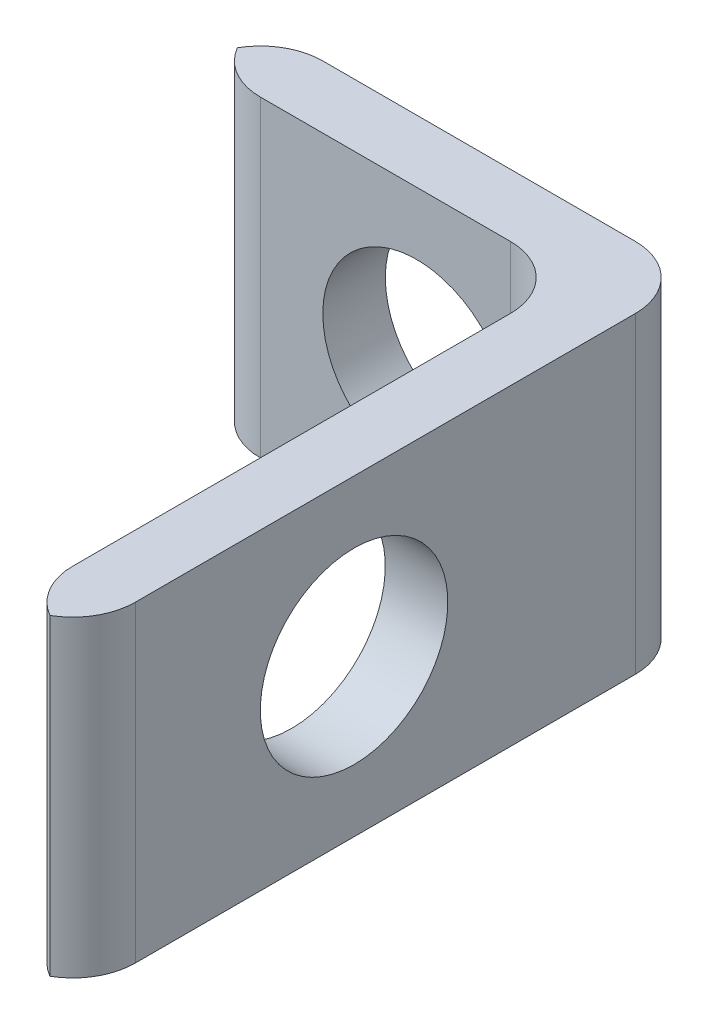
ISO-10303-21;
HEADER;
FILE_DESCRIPTION(('STEP AP214'),'2;1');
FILE_NAME('part.step','',(''),(''),'','','');
FILE_SCHEMA(('AUTOMOTIVE_DESIGN { 1 0 10303 214 1 1 1 1 }'));
ENDSEC;
DATA;
#1=APPLICATION_CONTEXT('core data for automotive mechanical design processes');
#2=APPLICATION_PROTOCOL_DEFINITION('international standard','automotive_design',2000,#1);
#3=PRODUCT_CONTEXT('',#1,'mechanical');
#4=PRODUCT('Part','Part','',(#3));
#5=PRODUCT_RELATED_PRODUCT_CATEGORY('part','',(#4));
#6=PRODUCT_DEFINITION_FORMATION('','',#4);
#7=PRODUCT_DEFINITION_CONTEXT('part definition',#1,'design');
#8=PRODUCT_DEFINITION('design','',#6,#7);
#9=PRODUCT_DEFINITION_SHAPE('','',#8);
#10=(LENGTH_UNIT() NAMED_UNIT(*) SI_UNIT(.MILLI.,.METRE.));
#11=(NAMED_UNIT(*) PLANE_ANGLE_UNIT() SI_UNIT($,.RADIAN.));
#12=(NAMED_UNIT(*) SI_UNIT($,.STERADIAN.) SOLID_ANGLE_UNIT());
#13=UNCERTAINTY_MEASURE_WITH_UNIT(LENGTH_MEASURE(1.E-05),#10,'distance_accuracy_value','');
#14=(GEOMETRIC_REPRESENTATION_CONTEXT(3) GLOBAL_UNCERTAINTY_ASSIGNED_CONTEXT((#13)) GLOBAL_UNIT_ASSIGNED_CONTEXT((#10,
#11,#12)) REPRESENTATION_CONTEXT('',''));
#15=CARTESIAN_POINT('',(0.,0.,0.));
#16=DIRECTION('',(0.,0.,1.));
#17=DIRECTION('',(1.,0.,0.));
#18=AXIS2_PLACEMENT_3D('',#15,#16,#17);
#19=CARTESIAN_POINT('',(0.,0.,1.));
#20=DIRECTION('',(0.,0.,-1.));
#21=DIRECTION('',(-1.,0.,0.));
#22=AXIS2_PLACEMENT_3D('',#19,#20,#21);
#23=PLANE('',#22);
#24=DIRECTION('',(-1.,0.,0.));
#25=VECTOR('',#24,1.);
#26=CARTESIAN_POINT('',(0.,5.,1.));
#27=LINE('',#26,#25);
#28=CARTESIAN_POINT('',(5.,5.,1.));
#29=VERTEX_POINT('',#28);
#30=CARTESIAN_POINT('',(1.,5.,1.));
#31=VERTEX_POINT('',#30);
#32=EDGE_CURVE('E230',#29,#31,#27,.T.);
#33=ORIENTED_EDGE('',*,*,#32,.T.);
#34=DIRECTION('',(0.,-1.,0.));
#35=VECTOR('',#34,1.);
#36=CARTESIAN_POINT('',(1.,0.,1.));
#37=LINE('',#36,#35);
#38=CARTESIAN_POINT('',(1.,0.,1.));
#39=VERTEX_POINT('',#38);
#40=EDGE_CURVE('E201',#31,#39,#37,.T.);
#41=ORIENTED_EDGE('',*,*,#40,.T.);
#42=DIRECTION('',(1.,0.,0.));
#43=VECTOR('',#42,1.);
#44=CARTESIAN_POINT('',(0.,0.,1.));
#45=LINE('',#44,#43);
#46=CARTESIAN_POINT('',(5.,0.,1.));
#47=VERTEX_POINT('',#46);
#48=EDGE_CURVE('E233',#39,#47,#45,.T.);
#49=ORIENTED_EDGE('',*,*,#48,.T.);
#50=DIRECTION('',(0.,-1.,0.));
#51=VECTOR('',#50,1.);
#52=CARTESIAN_POINT('',(5.,5.,1.));
#53=LINE('',#52,#51);
#54=CARTESIAN_POINT('',(5.,2.5,1.));
#55=VERTEX_POINT('',#54);
#56=EDGE_CURVE('E144',#47,#55,#53,.F.);
#57=ORIENTED_EDGE('',*,*,#56,.T.);
#58=CARTESIAN_POINT('',(3.5,2.5,1.));
#59=DIRECTION('',(0.,0.,1.));
#60=DIRECTION('',(1.,0.,0.));
#61=AXIS2_PLACEMENT_3D('',#58,#59,#60);
#62=CIRCLE('',#61,1.5);
#63=EDGE_CURVE('E241',#55,#55,#62,.T.);
#64=ORIENTED_EDGE('',*,*,#63,.F.);
#65=DIRECTION('',(0.,-1.,0.));
#66=VECTOR('',#65,1.);
#67=CARTESIAN_POINT('',(5.,5.,1.));
#68=LINE('',#67,#66);
#69=EDGE_CURVE('E152',#55,#29,#68,.F.);
#70=ORIENTED_EDGE('',*,*,#69,.T.);
#71=EDGE_LOOP('',(#33,#41,#49,#57,#64,#70));
#72=FACE_BOUND('',#71,.T.);
#73=ADVANCED_FACE('F43',(#72),#23,.F.);
#74=CARTESIAN_POINT('',(0.,0.,0.));
#75=DIRECTION('',(0.,0.,-1.));
#76=DIRECTION('',(-1.,0.,0.));
#77=AXIS2_PLACEMENT_3D('',#74,#75,#76);
#78=PLANE('',#77);
#79=DIRECTION('',(-1.,0.,0.));
#80=VECTOR('',#79,1.);
#81=CARTESIAN_POINT('',(0.,5.,0.));
#82=LINE('',#81,#80);
#83=CARTESIAN_POINT('',(6.,5.,0.));
#84=VERTEX_POINT('',#83);
#85=CARTESIAN_POINT('',(1.,5.,0.));
#86=VERTEX_POINT('',#85);
#87=EDGE_CURVE('E236',#84,#86,#82,.T.);
#88=ORIENTED_EDGE('',*,*,#87,.F.);
#89=DIRECTION('',(0.,1.,0.));
#90=VECTOR('',#89,1.);
#91=CARTESIAN_POINT('',(6.,0.,0.));
#92=LINE('',#91,#90);
#93=CARTESIAN_POINT('',(6.,0.,0.));
#94=VERTEX_POINT('',#93);
#95=EDGE_CURVE('E52',#84,#94,#92,.F.);
#96=ORIENTED_EDGE('',*,*,#95,.T.);
#97=DIRECTION('',(1.,0.,0.));
#98=VECTOR('',#97,1.);
#99=CARTESIAN_POINT('',(0.,0.,0.));
#100=LINE('',#99,#98);
#101=CARTESIAN_POINT('',(1.,0.,0.));
#102=VERTEX_POINT('',#101);
#103=EDGE_CURVE('E239',#102,#94,#100,.T.);
#104=ORIENTED_EDGE('',*,*,#103,.F.);
#105=DIRECTION('',(0.,-1.,0.));
#106=VECTOR('',#105,1.);
#107=CARTESIAN_POINT('',(1.,5.,0.));
#108=LINE('',#107,#106);
#109=EDGE_CURVE('E197',#102,#86,#108,.F.);
#110=ORIENTED_EDGE('',*,*,#109,.T.);
#111=EDGE_LOOP('',(#88,#96,#104,#110));
#112=FACE_BOUND('',#111,.T.);
#113=CARTESIAN_POINT('',(3.5,2.5,0.));
#114=DIRECTION('',(0.,0.,1.));
#115=DIRECTION('',(1.,0.,0.));
#116=AXIS2_PLACEMENT_3D('',#113,#114,#115);
#117=CIRCLE('',#116,1.5);
#118=CARTESIAN_POINT('',(5.,2.5,0.));
#119=VERTEX_POINT('',#118);
#120=EDGE_CURVE('E245',#119,#119,#117,.T.);
#121=ORIENTED_EDGE('',*,*,#120,.T.);
#122=EDGE_LOOP('',(#121));
#123=FACE_BOUND('',#122,.T.);
#124=ADVANCED_FACE('F277',(#112,#123),#78,.T.);
#125=CARTESIAN_POINT('',(0.,0.,1.));
#126=DIRECTION('',(0.,1.,0.));
#127=DIRECTION('',(0.,0.,1.));
#128=AXIS2_PLACEMENT_3D('',#125,#126,#127);
#129=PLANE('',#128);
#130=ORIENTED_EDGE('',*,*,#103,.T.);
#131=CARTESIAN_POINT('',(6.,0.,1.));
#132=DIRECTION('',(0.,1.,0.));
#133=DIRECTION('',(0.,0.,1.));
#134=AXIS2_PLACEMENT_3D('',#131,#132,#133);
#135=CIRCLE('',#134,1.);
#136=CARTESIAN_POINT('',(7.,0.,1.));
#137=VERTEX_POINT('',#136);
#138=EDGE_CURVE('E11',#94,#137,#135,.F.);
#139=ORIENTED_EDGE('',*,*,#138,.T.);
#140=DIRECTION('',(0.,0.,-1.));
#141=VECTOR('',#140,1.);
#142=CARTESIAN_POINT('',(7.,0.,1.));
#143=LINE('',#142,#141);
#144=CARTESIAN_POINT('',(7.,0.,9.));
#145=VERTEX_POINT('',#144);
#146=EDGE_CURVE('E153',#145,#137,#143,.T.);
#147=ORIENTED_EDGE('',*,*,#146,.F.);
#148=CARTESIAN_POINT('',(6.,0.,9.));
#149=DIRECTION('',(0.,1.,0.));
#150=DIRECTION('',(0.,0.,1.));
#151=AXIS2_PLACEMENT_3D('',#148,#149,#150);
#152=CIRCLE('',#151,1.);
#153=CARTESIAN_POINT('',(6.5,0.,9.86602540378444));
#154=VERTEX_POINT('',#153);
#155=EDGE_CURVE('E191',#145,#154,#152,.F.);
#156=ORIENTED_EDGE('',*,*,#155,.T.);
#157=CARTESIAN_POINT('',(7.,0.,9.));
#158=DIRECTION('',(0.,1.,0.));
#159=DIRECTION('',(0.,0.,1.));
#160=AXIS2_PLACEMENT_3D('',#157,#158,#159);
#161=CIRCLE('',#160,1.);
#162=CARTESIAN_POINT('',(6.,0.,9.));
#163=VERTEX_POINT('',#162);
#164=EDGE_CURVE('E130',#154,#163,#161,.F.);
#165=ORIENTED_EDGE('',*,*,#164,.T.);
#166=DIRECTION('',(0.,0.,-1.));
#167=VECTOR('',#166,1.);
#168=CARTESIAN_POINT('',(6.,0.,10.));
#169=LINE('',#168,#167);
#170=CARTESIAN_POINT('',(6.,0.,2.));
#171=VERTEX_POINT('',#170);
#172=EDGE_CURVE('E123',#163,#171,#169,.T.);
#173=ORIENTED_EDGE('',*,*,#172,.T.);
#174=CARTESIAN_POINT('',(5.,0.,2.));
#175=DIRECTION('',(0.,1.,0.));
#176=DIRECTION('',(0.,0.,1.));
#177=AXIS2_PLACEMENT_3D('',#174,#175,#176);
#178=CIRCLE('',#177,1.);
#179=EDGE_CURVE('E127',#171,#47,#178,.T.);
#180=ORIENTED_EDGE('',*,*,#179,.T.);
#181=ORIENTED_EDGE('',*,*,#48,.F.);
#182=CARTESIAN_POINT('',(1.,0.,0.));
#183=DIRECTION('',(0.,1.,0.));
#184=DIRECTION('',(0.,0.,1.));
#185=AXIS2_PLACEMENT_3D('',#182,#183,#184);
#186=CIRCLE('',#185,1.);
#187=CARTESIAN_POINT('',(0.133974596215561,0.,0.5));
#188=VERTEX_POINT('',#187);
#189=EDGE_CURVE('E183',#39,#188,#186,.F.);
#190=ORIENTED_EDGE('',*,*,#189,.T.);
#191=CARTESIAN_POINT('',(1.,0.,1.));
#192=DIRECTION('',(0.,1.,0.));
#193=DIRECTION('',(0.,0.,1.));
#194=AXIS2_PLACEMENT_3D('',#191,#192,#193);
#195=CIRCLE('',#194,1.);
#196=EDGE_CURVE('E186',#188,#102,#195,.F.);
#197=ORIENTED_EDGE('',*,*,#196,.T.);
#198=EDGE_LOOP('',(#130,#139,#147,#156,#165,#173,#180,#181,#190,#197));
#199=FACE_BOUND('',#198,.T.);
#200=ADVANCED_FACE('F125',(#199),#129,.F.);
#201=CARTESIAN_POINT('',(7.,0.,1.));
#202=DIRECTION('',(-1.,0.,0.));
#203=DIRECTION('',(0.,0.,1.));
#204=AXIS2_PLACEMENT_3D('',#201,#202,#203);
#205=PLANE('',#204);
#206=CARTESIAN_POINT('',(7.,2.5,5.5));
#207=DIRECTION('',(-1.,0.,0.));
#208=DIRECTION('',(0.,-1.,0.));
#209=AXIS2_PLACEMENT_3D('',#206,#207,#208);
#210=CIRCLE('',#209,1.5);
#211=CARTESIAN_POINT('',(7.,1.,5.5));
#212=VERTEX_POINT('',#211);
#213=EDGE_CURVE('E136',#212,#212,#210,.T.);
#214=ORIENTED_EDGE('',*,*,#213,.T.);
#215=EDGE_LOOP('',(#214));
#216=FACE_BOUND('',#215,.T.);
#217=ORIENTED_EDGE('',*,*,#146,.T.);
#218=DIRECTION('',(0.,1.,0.));
#219=VECTOR('',#218,1.);
#220=CARTESIAN_POINT('',(7.,5.,1.));
#221=LINE('',#220,#219);
#222=CARTESIAN_POINT('',(7.,5.,1.));
#223=VERTEX_POINT('',#222);
#224=EDGE_CURVE('E204',#137,#223,#221,.T.);
#225=ORIENTED_EDGE('',*,*,#224,.T.);
#226=DIRECTION('',(0.,0.,-1.));
#227=VECTOR('',#226,1.);
#228=CARTESIAN_POINT('',(7.,5.,1.));
#229=LINE('',#228,#227);
#230=CARTESIAN_POINT('',(7.,5.,9.));
#231=VERTEX_POINT('',#230);
#232=EDGE_CURVE('E159',#231,#223,#229,.T.);
#233=ORIENTED_EDGE('',*,*,#232,.F.);
#234=DIRECTION('',(0.,1.,0.));
#235=VECTOR('',#234,1.);
#236=CARTESIAN_POINT('',(7.,0.,9.));
#237=LINE('',#236,#235);
#238=EDGE_CURVE('E179',#231,#145,#237,.F.);
#239=ORIENTED_EDGE('',*,*,#238,.T.);
#240=EDGE_LOOP('',(#217,#225,#233,#239));
#241=FACE_BOUND('',#240,.T.);
#242=ADVANCED_FACE('F222',(#216,#241),#205,.F.);
#243=CARTESIAN_POINT('',(0.,5.,1.));
#244=DIRECTION('',(0.,-1.,0.));
#245=DIRECTION('',(0.,0.,-1.));
#246=AXIS2_PLACEMENT_3D('',#243,#244,#245);
#247=PLANE('',#246);
#248=ORIENTED_EDGE('',*,*,#232,.T.);
#249=CARTESIAN_POINT('',(6.,5.,1.));
#250=DIRECTION('',(0.,-1.,0.));
#251=DIRECTION('',(0.,0.,-1.));
#252=AXIS2_PLACEMENT_3D('',#249,#250,#251);
#253=CIRCLE('',#252,1.);
#254=EDGE_CURVE('E66',#223,#84,#253,.F.);
#255=ORIENTED_EDGE('',*,*,#254,.T.);
#256=ORIENTED_EDGE('',*,*,#87,.T.);
#257=CARTESIAN_POINT('',(1.,5.,1.));
#258=DIRECTION('',(0.,-1.,0.));
#259=DIRECTION('',(0.,0.,-1.));
#260=AXIS2_PLACEMENT_3D('',#257,#258,#259);
#261=CIRCLE('',#260,1.);
#262=CARTESIAN_POINT('',(0.133974596215561,5.,0.5));
#263=VERTEX_POINT('',#262);
#264=EDGE_CURVE('E170',#86,#263,#261,.F.);
#265=ORIENTED_EDGE('',*,*,#264,.T.);
#266=CARTESIAN_POINT('',(1.,5.,0.));
#267=DIRECTION('',(0.,-1.,0.));
#268=DIRECTION('',(0.,0.,-1.));
#269=AXIS2_PLACEMENT_3D('',#266,#267,#268);
#270=CIRCLE('',#269,1.);
#271=EDGE_CURVE('E167',#263,#31,#270,.F.);
#272=ORIENTED_EDGE('',*,*,#271,.T.);
#273=ORIENTED_EDGE('',*,*,#32,.F.);
#274=CARTESIAN_POINT('',(5.,5.,2.));
#275=DIRECTION('',(0.,-1.,0.));
#276=DIRECTION('',(0.,0.,-1.));
#277=AXIS2_PLACEMENT_3D('',#274,#275,#276);
#278=CIRCLE('',#277,1.);
#279=CARTESIAN_POINT('',(6.,5.,2.));
#280=VERTEX_POINT('',#279);
#281=EDGE_CURVE('E146',#29,#280,#278,.T.);
#282=ORIENTED_EDGE('',*,*,#281,.T.);
#283=DIRECTION('',(0.,0.,-1.));
#284=VECTOR('',#283,1.);
#285=CARTESIAN_POINT('',(6.,5.,10.));
#286=LINE('',#285,#284);
#287=CARTESIAN_POINT('',(6.,5.,9.));
#288=VERTEX_POINT('',#287);
#289=EDGE_CURVE('E135',#288,#280,#286,.T.);
#290=ORIENTED_EDGE('',*,*,#289,.F.);
#291=CARTESIAN_POINT('',(7.,5.,9.));
#292=DIRECTION('',(0.,-1.,0.));
#293=DIRECTION('',(0.,0.,-1.));
#294=AXIS2_PLACEMENT_3D('',#291,#292,#293);
#295=CIRCLE('',#294,1.);
#296=CARTESIAN_POINT('',(6.5,5.,9.86602540378444));
#297=VERTEX_POINT('',#296);
#298=EDGE_CURVE('E173',#288,#297,#295,.F.);
#299=ORIENTED_EDGE('',*,*,#298,.T.);
#300=CARTESIAN_POINT('',(6.,5.,9.));
#301=DIRECTION('',(0.,-1.,0.));
#302=DIRECTION('',(0.,0.,-1.));
#303=AXIS2_PLACEMENT_3D('',#300,#301,#302);
#304=CIRCLE('',#303,1.);
#305=EDGE_CURVE('E176',#297,#231,#304,.F.);
#306=ORIENTED_EDGE('',*,*,#305,.T.);
#307=EDGE_LOOP('',(#248,#255,#256,#265,#272,#273,#282,#290,#299,#306));
#308=FACE_BOUND('',#307,.T.);
#309=ADVANCED_FACE('F227',(#308),#247,.F.);
#310=CARTESIAN_POINT('',(3.5,2.5,1.));
#311=DIRECTION('',(0.,0.,-1.));
#312=DIRECTION('',(-1.,0.,0.));
#313=AXIS2_PLACEMENT_3D('',#310,#311,#312);
#314=CYLINDRICAL_SURFACE('',#313,1.5);
#315=ORIENTED_EDGE('',*,*,#63,.T.);
#316=EDGE_LOOP('',(#315));
#317=FACE_BOUND('',#316,.T.);
#318=ORIENTED_EDGE('',*,*,#120,.F.);
#319=EDGE_LOOP('',(#318));
#320=FACE_BOUND('',#319,.T.);
#321=ADVANCED_FACE('F269',(#317,#320),#314,.F.);
#322=CARTESIAN_POINT('',(6.,5.,10.));
#323=DIRECTION('',(1.,0.,0.));
#324=DIRECTION('',(0.,1.,0.));
#325=AXIS2_PLACEMENT_3D('',#322,#323,#324);
#326=PLANE('',#325);
#327=CARTESIAN_POINT('',(6.,2.5,5.5));
#328=DIRECTION('',(-1.,0.,0.));
#329=DIRECTION('',(0.,-1.,0.));
#330=AXIS2_PLACEMENT_3D('',#327,#328,#329);
#331=CIRCLE('',#330,1.5);
#332=CARTESIAN_POINT('',(6.,1.,5.5));
#333=VERTEX_POINT('',#332);
#334=EDGE_CURVE('E209',#333,#333,#331,.T.);
#335=ORIENTED_EDGE('',*,*,#334,.F.);
#336=EDGE_LOOP('',(#335));
#337=FACE_BOUND('',#336,.T.);
#338=ORIENTED_EDGE('',*,*,#172,.F.);
#339=DIRECTION('',(0.,-1.,0.));
#340=VECTOR('',#339,1.);
#341=CARTESIAN_POINT('',(6.,5.,9.));
#342=LINE('',#341,#340);
#343=EDGE_CURVE('E194',#163,#288,#342,.F.);
#344=ORIENTED_EDGE('',*,*,#343,.T.);
#345=ORIENTED_EDGE('',*,*,#289,.T.);
#346=DIRECTION('',(0.,-1.,0.));
#347=VECTOR('',#346,1.);
#348=CARTESIAN_POINT('',(6.,0.,2.));
#349=LINE('',#348,#347);
#350=EDGE_CURVE('E143',#280,#171,#349,.T.);
#351=ORIENTED_EDGE('',*,*,#350,.T.);
#352=EDGE_LOOP('',(#338,#344,#345,#351));
#353=FACE_BOUND('',#352,.T.);
#354=ADVANCED_FACE('F148',(#337,#353),#326,.F.);
#355=CARTESIAN_POINT('',(7.,2.5,5.5));
#356=DIRECTION('',(-1.,0.,0.));
#357=DIRECTION('',(0.,-1.,0.));
#358=AXIS2_PLACEMENT_3D('',#355,#356,#357);
#359=CYLINDRICAL_SURFACE('',#358,1.5);
#360=ORIENTED_EDGE('',*,*,#213,.F.);
#361=EDGE_LOOP('',(#360));
#362=FACE_BOUND('',#361,.T.);
#363=ORIENTED_EDGE('',*,*,#334,.T.);
#364=EDGE_LOOP('',(#363));
#365=FACE_BOUND('',#364,.T.);
#366=ADVANCED_FACE('F262',(#362,#365),#359,.F.);
#367=CARTESIAN_POINT('',(5.,5.,2.));
#368=DIRECTION('',(0.,1.,0.));
#369=DIRECTION('',(-1.,0.,0.));
#370=AXIS2_PLACEMENT_3D('',#367,#368,#369);
#371=CYLINDRICAL_SURFACE('',#370,1.);
#372=ORIENTED_EDGE('',*,*,#69,.F.);
#373=ORIENTED_EDGE('',*,*,#56,.F.);
#374=ORIENTED_EDGE('',*,*,#179,.F.);
#375=ORIENTED_EDGE('',*,*,#350,.F.);
#376=ORIENTED_EDGE('',*,*,#281,.F.);
#377=EDGE_LOOP('',(#372,#373,#374,#375,#376));
#378=FACE_BOUND('',#377,.T.);
#379=ADVANCED_FACE('F141',(#378),#371,.F.);
#380=CARTESIAN_POINT('',(7.,0.,9.));
#381=DIRECTION('',(0.,-1.,0.));
#382=DIRECTION('',(1.,0.,0.));
#383=AXIS2_PLACEMENT_3D('',#380,#381,#382);
#384=CYLINDRICAL_SURFACE('',#383,1.);
#385=ORIENTED_EDGE('',*,*,#343,.F.);
#386=ORIENTED_EDGE('',*,*,#164,.F.);
#387=DIRECTION('',(0.,-1.,0.));
#388=VECTOR('',#387,1.);
#389=CARTESIAN_POINT('',(6.5,2.5,9.86602540378444));
#390=LINE('',#389,#388);
#391=EDGE_CURVE('E205',#297,#154,#390,.T.);
#392=ORIENTED_EDGE('',*,*,#391,.F.);
#393=ORIENTED_EDGE('',*,*,#298,.F.);
#394=EDGE_LOOP('',(#385,#386,#392,#393));
#395=FACE_BOUND('',#394,.T.);
#396=ADVANCED_FACE('F293',(#395),#384,.T.);
#397=CARTESIAN_POINT('',(6.,0.,9.));
#398=DIRECTION('',(0.,1.,0.));
#399=DIRECTION('',(0.,0.,1.));
#400=AXIS2_PLACEMENT_3D('',#397,#398,#399);
#401=CYLINDRICAL_SURFACE('',#400,1.);
#402=ORIENTED_EDGE('',*,*,#155,.F.);
#403=ORIENTED_EDGE('',*,*,#238,.F.);
#404=ORIENTED_EDGE('',*,*,#305,.F.);
#405=ORIENTED_EDGE('',*,*,#391,.T.);
#406=EDGE_LOOP('',(#402,#403,#404,#405));
#407=FACE_BOUND('',#406,.T.);
#408=ADVANCED_FACE('F294',(#407),#401,.T.);
#409=CARTESIAN_POINT('',(1.,0.,0.));
#410=DIRECTION('',(0.,-1.,0.));
#411=DIRECTION('',(0.,0.,-1.));
#412=AXIS2_PLACEMENT_3D('',#409,#410,#411);
#413=CYLINDRICAL_SURFACE('',#412,1.);
#414=ORIENTED_EDGE('',*,*,#40,.F.);
#415=ORIENTED_EDGE('',*,*,#271,.F.);
#416=DIRECTION('',(0.,-1.,0.));
#417=VECTOR('',#416,1.);
#418=CARTESIAN_POINT('',(0.133974596215561,2.5,0.5));
#419=LINE('',#418,#417);
#420=EDGE_CURVE('E210',#188,#263,#419,.F.);
#421=ORIENTED_EDGE('',*,*,#420,.F.);
#422=ORIENTED_EDGE('',*,*,#189,.F.);
#423=EDGE_LOOP('',(#414,#415,#421,#422));
#424=FACE_BOUND('',#423,.T.);
#425=ADVANCED_FACE('F297',(#424),#413,.T.);
#426=CARTESIAN_POINT('',(1.,0.,1.));
#427=DIRECTION('',(0.,1.,0.));
#428=DIRECTION('',(0.,0.,1.));
#429=AXIS2_PLACEMENT_3D('',#426,#427,#428);
#430=CYLINDRICAL_SURFACE('',#429,1.);
#431=ORIENTED_EDGE('',*,*,#264,.F.);
#432=ORIENTED_EDGE('',*,*,#109,.F.);
#433=ORIENTED_EDGE('',*,*,#196,.F.);
#434=ORIENTED_EDGE('',*,*,#420,.T.);
#435=EDGE_LOOP('',(#431,#432,#433,#434));
#436=FACE_BOUND('',#435,.T.);
#437=ADVANCED_FACE('F302',(#436),#430,.T.);
#438=CARTESIAN_POINT('',(6.,0.,1.));
#439=DIRECTION('',(0.,-1.,0.));
#440=DIRECTION('',(0.,0.,-1.));
#441=AXIS2_PLACEMENT_3D('',#438,#439,#440);
#442=CYLINDRICAL_SURFACE('',#441,1.);
#443=ORIENTED_EDGE('',*,*,#138,.F.);
#444=ORIENTED_EDGE('',*,*,#95,.F.);
#445=ORIENTED_EDGE('',*,*,#254,.F.);
#446=ORIENTED_EDGE('',*,*,#224,.F.);
#447=EDGE_LOOP('',(#443,#444,#445,#446));
#448=FACE_BOUND('',#447,.T.);
#449=ADVANCED_FACE('F45',(#448),#442,.T.);
#450=CLOSED_SHELL('',(#73,#124,#200,#242,#309,#321,#354,#366,#379,#396,#408,#425,#437,#449));
#451=MANIFOLD_SOLID_BREP('B2',#450);
#452=ADVANCED_BREP_SHAPE_REPRESENTATION('',(#18,#451),#14);
#453=SHAPE_DEFINITION_REPRESENTATION(#9,#452);
ENDSEC;
END-ISO-10303-21;
